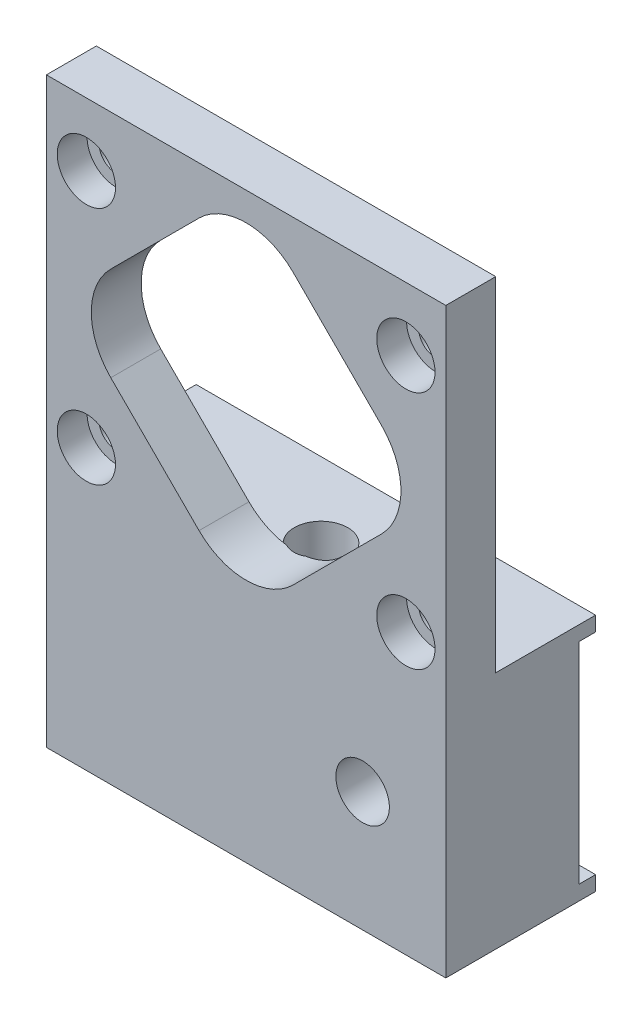
ISO-10303-21;
HEADER;
FILE_DESCRIPTION(('STEP AP214'),'2;1');
FILE_NAME('part.step','',(''),(''),'','','');
FILE_SCHEMA(('AUTOMOTIVE_DESIGN { 1 0 10303 214 1 1 1 1 }'));
ENDSEC;
DATA;
#1=APPLICATION_CONTEXT('core data for automotive mechanical design processes');
#2=APPLICATION_PROTOCOL_DEFINITION('international standard','automotive_design',2000,#1);
#3=PRODUCT_CONTEXT('',#1,'mechanical');
#4=PRODUCT('Part','Part','',(#3));
#5=PRODUCT_RELATED_PRODUCT_CATEGORY('part','',(#4));
#6=PRODUCT_DEFINITION_FORMATION('','',#4);
#7=PRODUCT_DEFINITION_CONTEXT('part definition',#1,'design');
#8=PRODUCT_DEFINITION('design','',#6,#7);
#9=PRODUCT_DEFINITION_SHAPE('','',#8);
#10=(LENGTH_UNIT() NAMED_UNIT(*) SI_UNIT(.MILLI.,.METRE.));
#11=(NAMED_UNIT(*) PLANE_ANGLE_UNIT() SI_UNIT($,.RADIAN.));
#12=(NAMED_UNIT(*) SI_UNIT($,.STERADIAN.) SOLID_ANGLE_UNIT());
#13=UNCERTAINTY_MEASURE_WITH_UNIT(LENGTH_MEASURE(1.E-05),#10,'distance_accuracy_value','');
#14=(GEOMETRIC_REPRESENTATION_CONTEXT(3) GLOBAL_UNCERTAINTY_ASSIGNED_CONTEXT((#13)) GLOBAL_UNIT_ASSIGNED_CONTEXT((#10,
#11,#12)) REPRESENTATION_CONTEXT('',''));
#15=CARTESIAN_POINT('',(0.,0.,0.));
#16=DIRECTION('',(0.,0.,1.));
#17=DIRECTION('',(1.,0.,0.));
#18=AXIS2_PLACEMENT_3D('',#15,#16,#17);
#19=CARTESIAN_POINT('',(19.05,-28.067,0.));
#20=DIRECTION('',(0.,0.,1.));
#21=DIRECTION('',(1.,0.,0.));
#22=AXIS2_PLACEMENT_3D('',#19,#20,#21);
#23=PLANE('',#22);
#24=DIRECTION('',(0.,1.,0.));
#25=VECTOR('',#24,1.);
#26=CARTESIAN_POINT('',(19.05,28.067,0.));
#27=LINE('',#26,#25);
#28=CARTESIAN_POINT('',(19.05,-6.62940000000001,0.));
#29=VERTEX_POINT('',#28);
#30=CARTESIAN_POINT('',(19.05,-5.23240000000001,0.));
#31=VERTEX_POINT('',#30);
#32=EDGE_CURVE('E309',#29,#31,#27,.T.);
#33=ORIENTED_EDGE('',*,*,#32,.F.);
#34=DIRECTION('',(1.,0.,0.));
#35=VECTOR('',#34,1.);
#36=CARTESIAN_POINT('',(19.05,-6.62940000000001,0.));
#37=LINE('',#36,#35);
#38=CARTESIAN_POINT('',(-19.05,-6.62940000000001,0.));
#39=VERTEX_POINT('',#38);
#40=EDGE_CURVE('E201',#39,#29,#37,.T.);
#41=ORIENTED_EDGE('',*,*,#40,.F.);
#42=DIRECTION('',(0.,-1.,0.));
#43=VECTOR('',#42,1.);
#44=CARTESIAN_POINT('',(-19.05,28.067,0.));
#45=LINE('',#44,#43);
#46=CARTESIAN_POINT('',(-19.05,-5.23240000000001,0.));
#47=VERTEX_POINT('',#46);
#48=EDGE_CURVE('E323',#47,#39,#45,.T.);
#49=ORIENTED_EDGE('',*,*,#48,.F.);
#50=DIRECTION('',(-1.,0.,0.));
#51=VECTOR('',#50,1.);
#52=CARTESIAN_POINT('',(-19.05,-5.23240000000001,0.));
#53=LINE('',#52,#51);
#54=EDGE_CURVE('E303',#31,#47,#53,.T.);
#55=ORIENTED_EDGE('',*,*,#54,.F.);
#56=EDGE_LOOP('',(#33,#41,#49,#55));
#57=FACE_BOUND('',#56,.T.);
#58=ADVANCED_FACE('F46',(#57),#23,.F.);
#59=CARTESIAN_POINT('',(11.1125,-16.6497,0.));
#60=DIRECTION('',(0.,0.,-1.));
#61=DIRECTION('',(-1.,0.,0.));
#62=AXIS2_PLACEMENT_3D('',#59,#60,#61);
#63=CYLINDRICAL_SURFACE('',#62,2.55269999999999);
#64=CARTESIAN_POINT('',(11.1125,-16.6497,14.2875));
#65=DIRECTION('',(0.,0.,-1.));
#66=DIRECTION('',(-1.,0.,0.));
#67=AXIS2_PLACEMENT_3D('',#64,#65,#66);
#68=CIRCLE('',#67,2.5527);
#69=CARTESIAN_POINT('',(8.55980000000002,-16.6497,14.2875));
#70=VERTEX_POINT('',#69);
#71=EDGE_CURVE('E214',#70,#70,#68,.T.);
#72=ORIENTED_EDGE('',*,*,#71,.F.);
#73=EDGE_LOOP('',(#72));
#74=FACE_BOUND('',#73,.T.);
#75=CARTESIAN_POINT('',(11.1125,-16.6497,1.5875));
#76=DIRECTION('',(0.,0.,-1.));
#77=DIRECTION('',(-1.,0.,0.));
#78=AXIS2_PLACEMENT_3D('',#75,#76,#77);
#79=CIRCLE('',#78,2.55269999999999);
#80=CARTESIAN_POINT('',(8.55980000000002,-16.6497,1.5875));
#81=VERTEX_POINT('',#80);
#82=EDGE_CURVE('E50',#81,#81,#79,.F.);
#83=ORIENTED_EDGE('',*,*,#82,.F.);
#84=EDGE_LOOP('',(#83));
#85=FACE_BOUND('',#84,.T.);
#86=ADVANCED_FACE('F389',(#74,#85),#63,.F.);
#87=CARTESIAN_POINT('',(19.05,28.067,14.2875));
#88=DIRECTION('',(-1.,0.,0.));
#89=DIRECTION('',(0.,-1.,0.));
#90=AXIS2_PLACEMENT_3D('',#87,#88,#89);
#91=PLANE('',#90);
#92=DIRECTION('',(0.,-1.,0.));
#93=VECTOR('',#92,1.);
#94=CARTESIAN_POINT('',(19.05,-6.62940000000001,1.5875));
#95=LINE('',#94,#93);
#96=CARTESIAN_POINT('',(19.05,-6.62940000000001,1.5875));
#97=VERTEX_POINT('',#96);
#98=CARTESIAN_POINT('',(19.05,-26.67,1.5875));
#99=VERTEX_POINT('',#98);
#100=EDGE_CURVE('E191',#97,#99,#95,.T.);
#101=ORIENTED_EDGE('',*,*,#100,.F.);
#102=DIRECTION('',(0.,0.,-1.));
#103=VECTOR('',#102,1.);
#104=CARTESIAN_POINT('',(19.05,-6.62940000000001,1.5875));
#105=LINE('',#104,#103);
#106=EDGE_CURVE('E443',#97,#29,#105,.T.);
#107=ORIENTED_EDGE('',*,*,#106,.T.);
#108=ORIENTED_EDGE('',*,*,#32,.T.);
#109=DIRECTION('',(0.,0.,-1.));
#110=VECTOR('',#109,1.);
#111=CARTESIAN_POINT('',(19.05,-5.23240000000001,0.));
#112=LINE('',#111,#110);
#113=CARTESIAN_POINT('',(19.05,-5.23240000000001,9.525));
#114=VERTEX_POINT('',#113);
#115=EDGE_CURVE('E300',#114,#31,#112,.T.);
#116=ORIENTED_EDGE('',*,*,#115,.F.);
#117=DIRECTION('',(0.,1.,0.));
#118=VECTOR('',#117,1.);
#119=CARTESIAN_POINT('',(19.05,-5.23240000000001,9.525));
#120=LINE('',#119,#118);
#121=CARTESIAN_POINT('',(19.05,27.4955,9.525));
#122=VERTEX_POINT('',#121);
#123=EDGE_CURVE('E306',#114,#122,#120,.T.);
#124=ORIENTED_EDGE('',*,*,#123,.T.);
#125=DIRECTION('',(0.,0.,-1.));
#126=VECTOR('',#125,1.);
#127=CARTESIAN_POINT('',(19.05,27.4955,9.525));
#128=LINE('',#127,#126);
#129=CARTESIAN_POINT('',(19.05,27.4955,14.2875));
#130=VERTEX_POINT('',#129);
#131=EDGE_CURVE('E71',#130,#122,#128,.T.);
#132=ORIENTED_EDGE('',*,*,#131,.F.);
#133=DIRECTION('',(0.,1.,0.));
#134=VECTOR('',#133,1.);
#135=CARTESIAN_POINT('',(19.05,28.067,14.2875));
#136=LINE('',#135,#134);
#137=CARTESIAN_POINT('',(19.05,-28.067,14.2875));
#138=VERTEX_POINT('',#137);
#139=EDGE_CURVE('E312',#138,#130,#136,.T.);
#140=ORIENTED_EDGE('',*,*,#139,.F.);
#141=DIRECTION('',(0.,0.,-1.));
#142=VECTOR('',#141,1.);
#143=CARTESIAN_POINT('',(19.05,-28.067,14.2875));
#144=LINE('',#143,#142);
#145=CARTESIAN_POINT('',(19.05,-28.067,0.));
#146=VERTEX_POINT('',#145);
#147=EDGE_CURVE('E320',#138,#146,#144,.T.);
#148=ORIENTED_EDGE('',*,*,#147,.T.);
#149=CARTESIAN_POINT('',(19.05,-26.67,0.));
#150=VERTEX_POINT('',#149);
#151=EDGE_CURVE('E207',#146,#150,#27,.T.);
#152=ORIENTED_EDGE('',*,*,#151,.T.);
#153=DIRECTION('',(0.,0.,-1.));
#154=VECTOR('',#153,1.);
#155=CARTESIAN_POINT('',(19.05,-26.67,1.5875));
#156=LINE('',#155,#154);
#157=EDGE_CURVE('E63',#99,#150,#156,.T.);
#158=ORIENTED_EDGE('',*,*,#157,.F.);
#159=EDGE_LOOP('',(#101,#107,#108,#116,#124,#132,#140,#148,#152,#158));
#160=FACE_BOUND('',#159,.T.);
#161=ADVANCED_FACE('F204',(#160),#91,.F.);
#162=CARTESIAN_POINT('',(-19.05,28.067,14.2875));
#163=DIRECTION('',(1.,0.,0.));
#164=DIRECTION('',(0.,1.,0.));
#165=AXIS2_PLACEMENT_3D('',#162,#163,#164);
#166=PLANE('',#165);
#167=ORIENTED_EDGE('',*,*,#48,.T.);
#168=DIRECTION('',(0.,0.,-1.));
#169=VECTOR('',#168,1.);
#170=CARTESIAN_POINT('',(-19.05,-6.62940000000001,1.5875));
#171=LINE('',#170,#169);
#172=CARTESIAN_POINT('',(-19.05,-6.62940000000001,1.5875));
#173=VERTEX_POINT('',#172);
#174=EDGE_CURVE('E209',#173,#39,#171,.T.);
#175=ORIENTED_EDGE('',*,*,#174,.F.);
#176=DIRECTION('',(0.,1.,0.));
#177=VECTOR('',#176,1.);
#178=CARTESIAN_POINT('',(-19.05,-6.62940000000001,1.5875));
#179=LINE('',#178,#177);
#180=CARTESIAN_POINT('',(-19.05,-26.67,1.5875));
#181=VERTEX_POINT('',#180);
#182=EDGE_CURVE('E190',#181,#173,#179,.T.);
#183=ORIENTED_EDGE('',*,*,#182,.F.);
#184=DIRECTION('',(0.,0.,-1.));
#185=VECTOR('',#184,1.);
#186=CARTESIAN_POINT('',(-19.05,-26.67,1.5875));
#187=LINE('',#186,#185);
#188=CARTESIAN_POINT('',(-19.05,-26.67,0.));
#189=VERTEX_POINT('',#188);
#190=EDGE_CURVE('E187',#181,#189,#187,.T.);
#191=ORIENTED_EDGE('',*,*,#190,.T.);
#192=CARTESIAN_POINT('',(-19.05,-28.067,0.));
#193=VERTEX_POINT('',#192);
#194=EDGE_CURVE('E322',#189,#193,#45,.T.);
#195=ORIENTED_EDGE('',*,*,#194,.T.);
#196=DIRECTION('',(0.,0.,-1.));
#197=VECTOR('',#196,1.);
#198=CARTESIAN_POINT('',(-19.05,-28.067,14.2875));
#199=LINE('',#198,#197);
#200=CARTESIAN_POINT('',(-19.05,-28.067,14.2875));
#201=VERTEX_POINT('',#200);
#202=EDGE_CURVE('E328',#201,#193,#199,.T.);
#203=ORIENTED_EDGE('',*,*,#202,.F.);
#204=DIRECTION('',(0.,-1.,0.));
#205=VECTOR('',#204,1.);
#206=CARTESIAN_POINT('',(-19.05,28.067,14.2875));
#207=LINE('',#206,#205);
#208=CARTESIAN_POINT('',(-19.05,27.4955,14.2875));
#209=VERTEX_POINT('',#208);
#210=EDGE_CURVE('E315',#209,#201,#207,.T.);
#211=ORIENTED_EDGE('',*,*,#210,.F.);
#212=DIRECTION('',(0.,0.,1.));
#213=VECTOR('',#212,1.);
#214=CARTESIAN_POINT('',(-19.05,27.4955,9.525));
#215=LINE('',#214,#213);
#216=CARTESIAN_POINT('',(-19.05,27.4955,9.525));
#217=VERTEX_POINT('',#216);
#218=EDGE_CURVE('E217',#217,#209,#215,.T.);
#219=ORIENTED_EDGE('',*,*,#218,.F.);
#220=DIRECTION('',(0.,1.,0.));
#221=VECTOR('',#220,1.);
#222=CARTESIAN_POINT('',(-19.05,-5.23240000000001,9.525));
#223=LINE('',#222,#221);
#224=CARTESIAN_POINT('',(-19.05,-5.23240000000001,9.525));
#225=VERTEX_POINT('',#224);
#226=EDGE_CURVE('E305',#225,#217,#223,.T.);
#227=ORIENTED_EDGE('',*,*,#226,.F.);
#228=DIRECTION('',(0.,0.,1.));
#229=VECTOR('',#228,1.);
#230=CARTESIAN_POINT('',(-19.05,-5.23240000000001,0.));
#231=LINE('',#230,#229);
#232=EDGE_CURVE('E294',#47,#225,#231,.T.);
#233=ORIENTED_EDGE('',*,*,#232,.F.);
#234=EDGE_LOOP('',(#167,#175,#183,#191,#195,#203,#211,#219,#227,#233));
#235=FACE_BOUND('',#234,.T.);
#236=ADVANCED_FACE('F417',(#235),#166,.F.);
#237=CARTESIAN_POINT('',(19.05,-28.067,14.2875));
#238=DIRECTION('',(0.,0.,1.));
#239=DIRECTION('',(1.,0.,0.));
#240=AXIS2_PLACEMENT_3D('',#237,#238,#239);
#241=PLANE('',#240);
#242=ORIENTED_EDGE('',*,*,#71,.T.);
#243=EDGE_LOOP('',(#242));
#244=FACE_BOUND('',#243,.T.);
#245=DIRECTION('',(0.707106781186548,0.707106781186548,0.));
#246=VECTOR('',#245,1.);
#247=CARTESIAN_POINT('',(0.,-7.36624623457149,14.2875));
#248=LINE('',#247,#246);
#249=CARTESIAN_POINT('',(4.49012806053458,-2.87611817403691,14.2875));
#250=VERTEX_POINT('',#249);
#251=CARTESIAN_POINT('',(12.9091181740369,5.54287193946543,14.2875));
#252=VERTEX_POINT('',#251);
#253=EDGE_CURVE('E275',#250,#252,#248,.T.);
#254=ORIENTED_EDGE('',*,*,#253,.F.);
#255=CARTESIAN_POINT('',(0.,1.61400988649767,14.2875));
#256=DIRECTION('',(0.,0.,1.));
#257=DIRECTION('',(1.,0.,0.));
#258=AXIS2_PLACEMENT_3D('',#255,#256,#257);
#259=CIRCLE('',#258,6.35);
#260=CARTESIAN_POINT('',(-4.49012806053458,-2.87611817403691,14.2875));
#261=VERTEX_POINT('',#260);
#262=EDGE_CURVE('E351',#250,#261,#259,.F.);
#263=ORIENTED_EDGE('',*,*,#262,.T.);
#264=DIRECTION('',(0.707106781186547,-0.707106781186548,0.));
#265=VECTOR('',#264,1.);
#266=CARTESIAN_POINT('',(0.,-7.36624623457149,14.2875));
#267=LINE('',#266,#265);
#268=CARTESIAN_POINT('',(-12.9091181740369,5.54287193946542,14.2875));
#269=VERTEX_POINT('',#268);
#270=EDGE_CURVE('E268',#269,#261,#267,.T.);
#271=ORIENTED_EDGE('',*,*,#270,.F.);
#272=CARTESIAN_POINT('',(-8.41899011350233,10.033,14.2875));
#273=DIRECTION('',(0.,0.,1.));
#274=DIRECTION('',(1.,0.,0.));
#275=AXIS2_PLACEMENT_3D('',#272,#273,#274);
#276=CIRCLE('',#275,6.35);
#277=CARTESIAN_POINT('',(-12.9091181740369,14.5231280605346,14.2875));
#278=VERTEX_POINT('',#277);
#279=EDGE_CURVE('E466',#269,#278,#276,.F.);
#280=ORIENTED_EDGE('',*,*,#279,.T.);
#281=DIRECTION('',(-0.707106781186547,-0.707106781186548,0.));
#282=VECTOR('',#281,1.);
#283=CARTESIAN_POINT('',(-17.3992462345715,10.033,14.2875));
#284=LINE('',#283,#282);
#285=CARTESIAN_POINT('',(-4.49012806053458,22.9421181740369,14.2875));
#286=VERTEX_POINT('',#285);
#287=EDGE_CURVE('E281',#286,#278,#284,.T.);
#288=ORIENTED_EDGE('',*,*,#287,.F.);
#289=CARTESIAN_POINT('',(0.,18.4519901135023,14.2875));
#290=DIRECTION('',(0.,0.,1.));
#291=DIRECTION('',(1.,0.,0.));
#292=AXIS2_PLACEMENT_3D('',#289,#290,#291);
#293=CIRCLE('',#292,6.35);
#294=CARTESIAN_POINT('',(4.49012806053457,22.9421181740369,14.2875));
#295=VERTEX_POINT('',#294);
#296=EDGE_CURVE('E460',#286,#295,#293,.F.);
#297=ORIENTED_EDGE('',*,*,#296,.T.);
#298=DIRECTION('',(-0.707106781186548,0.707106781186548,0.));
#299=VECTOR('',#298,1.);
#300=CARTESIAN_POINT('',(17.3992462345715,10.033,14.2875));
#301=LINE('',#300,#299);
#302=CARTESIAN_POINT('',(12.9091181740369,14.5231280605346,14.2875));
#303=VERTEX_POINT('',#302);
#304=EDGE_CURVE('E278',#303,#295,#301,.T.);
#305=ORIENTED_EDGE('',*,*,#304,.F.);
#306=CARTESIAN_POINT('',(8.41899011350233,10.033,14.2875));
#307=DIRECTION('',(0.,0.,1.));
#308=DIRECTION('',(1.,0.,0.));
#309=AXIS2_PLACEMENT_3D('',#306,#307,#308);
#310=CIRCLE('',#309,6.35);
#311=EDGE_CURVE('E455',#303,#252,#310,.F.);
#312=ORIENTED_EDGE('',*,*,#311,.T.);
#313=EDGE_LOOP('',(#254,#263,#271,#280,#288,#297,#305,#312));
#314=FACE_BOUND('',#313,.T.);
#315=CARTESIAN_POINT('',(-15.24,-1.397,14.2875));
#316=DIRECTION('',(0.,0.,1.));
#317=DIRECTION('',(1.,0.,0.));
#318=AXIS2_PLACEMENT_3D('',#315,#316,#317);
#319=CIRCLE('',#318,2.77875999999999);
#320=CARTESIAN_POINT('',(-12.46124,-1.397,14.2875));
#321=VERTEX_POINT('',#320);
#322=EDGE_CURVE('E254',#321,#321,#319,.T.);
#323=ORIENTED_EDGE('',*,*,#322,.F.);
#324=EDGE_LOOP('',(#323));
#325=FACE_BOUND('',#324,.T.);
#326=CARTESIAN_POINT('',(15.24,-1.397,14.2875));
#327=DIRECTION('',(0.,0.,1.));
#328=DIRECTION('',(1.,0.,0.));
#329=AXIS2_PLACEMENT_3D('',#326,#327,#328);
#330=CIRCLE('',#329,2.77875999999999);
#331=CARTESIAN_POINT('',(18.01876,-1.397,14.2875));
#332=VERTEX_POINT('',#331);
#333=EDGE_CURVE('E244',#332,#332,#330,.T.);
#334=ORIENTED_EDGE('',*,*,#333,.F.);
#335=EDGE_LOOP('',(#334));
#336=FACE_BOUND('',#335,.T.);
#337=CARTESIAN_POINT('',(15.24,21.463,14.2875));
#338=DIRECTION('',(0.,0.,1.));
#339=DIRECTION('',(1.,0.,0.));
#340=AXIS2_PLACEMENT_3D('',#337,#338,#339);
#341=CIRCLE('',#340,2.77876);
#342=CARTESIAN_POINT('',(18.01876,21.463,14.2875));
#343=VERTEX_POINT('',#342);
#344=EDGE_CURVE('E234',#343,#343,#341,.T.);
#345=ORIENTED_EDGE('',*,*,#344,.F.);
#346=EDGE_LOOP('',(#345));
#347=FACE_BOUND('',#346,.T.);
#348=CARTESIAN_POINT('',(-15.24,21.463,14.2875));
#349=DIRECTION('',(0.,0.,1.));
#350=DIRECTION('',(1.,0.,0.));
#351=AXIS2_PLACEMENT_3D('',#348,#349,#350);
#352=CIRCLE('',#351,2.77875999999999);
#353=CARTESIAN_POINT('',(-12.46124,21.463,14.2875));
#354=VERTEX_POINT('',#353);
#355=EDGE_CURVE('E224',#354,#354,#352,.T.);
#356=ORIENTED_EDGE('',*,*,#355,.F.);
#357=EDGE_LOOP('',(#356));
#358=FACE_BOUND('',#357,.T.);
#359=ORIENTED_EDGE('',*,*,#139,.T.);
#360=DIRECTION('',(1.,0.,0.));
#361=VECTOR('',#360,1.);
#362=CARTESIAN_POINT('',(-19.05,27.4955,14.2875));
#363=LINE('',#362,#361);
#364=EDGE_CURVE('E219',#209,#130,#363,.T.);
#365=ORIENTED_EDGE('',*,*,#364,.F.);
#366=ORIENTED_EDGE('',*,*,#210,.T.);
#367=DIRECTION('',(1.,0.,0.));
#368=VECTOR('',#367,1.);
#369=CARTESIAN_POINT('',(-19.05,-28.067,14.2875));
#370=LINE('',#369,#368);
#371=EDGE_CURVE('E318',#201,#138,#370,.T.);
#372=ORIENTED_EDGE('',*,*,#371,.T.);
#373=EDGE_LOOP('',(#359,#365,#366,#372));
#374=FACE_BOUND('',#373,.T.);
#375=ADVANCED_FACE('F424',(#244,#314,#325,#336,#347,#358,#374),#241,.T.);
#376=CARTESIAN_POINT('',(-19.05,-5.23240000000001,9.525));
#377=DIRECTION('',(0.,0.,1.));
#378=DIRECTION('',(1.,0.,0.));
#379=AXIS2_PLACEMENT_3D('',#376,#377,#378);
#380=PLANE('',#379);
#381=CARTESIAN_POINT('',(-15.24,-1.397,9.525));
#382=DIRECTION('',(0.,0.,1.));
#383=DIRECTION('',(1.,0.,0.));
#384=AXIS2_PLACEMENT_3D('',#381,#382,#383);
#385=CIRCLE('',#384,1.63195);
#386=CARTESIAN_POINT('',(-13.60805,-1.397,9.525));
#387=VERTEX_POINT('',#386);
#388=EDGE_CURVE('E263',#387,#387,#385,.T.);
#389=ORIENTED_EDGE('',*,*,#388,.T.);
#390=EDGE_LOOP('',(#389));
#391=FACE_BOUND('',#390,.T.);
#392=CARTESIAN_POINT('',(15.24,-1.397,9.525));
#393=DIRECTION('',(0.,0.,1.));
#394=DIRECTION('',(1.,0.,0.));
#395=AXIS2_PLACEMENT_3D('',#392,#393,#394);
#396=CIRCLE('',#395,1.63195000000001);
#397=CARTESIAN_POINT('',(16.87195,-1.397,9.525));
#398=VERTEX_POINT('',#397);
#399=EDGE_CURVE('E253',#398,#398,#396,.T.);
#400=ORIENTED_EDGE('',*,*,#399,.T.);
#401=EDGE_LOOP('',(#400));
#402=FACE_BOUND('',#401,.T.);
#403=CARTESIAN_POINT('',(15.24,21.463,9.525));
#404=DIRECTION('',(0.,0.,1.));
#405=DIRECTION('',(1.,0.,0.));
#406=AXIS2_PLACEMENT_3D('',#403,#404,#405);
#407=CIRCLE('',#406,1.63195000000001);
#408=CARTESIAN_POINT('',(16.87195,21.463,9.525));
#409=VERTEX_POINT('',#408);
#410=EDGE_CURVE('E243',#409,#409,#407,.T.);
#411=ORIENTED_EDGE('',*,*,#410,.T.);
#412=EDGE_LOOP('',(#411));
#413=FACE_BOUND('',#412,.T.);
#414=CARTESIAN_POINT('',(-15.24,21.463,9.525));
#415=DIRECTION('',(0.,0.,1.));
#416=DIRECTION('',(1.,0.,0.));
#417=AXIS2_PLACEMENT_3D('',#414,#415,#416);
#418=CIRCLE('',#417,1.63195);
#419=CARTESIAN_POINT('',(-13.60805,21.463,9.525));
#420=VERTEX_POINT('',#419);
#421=EDGE_CURVE('E233',#420,#420,#418,.T.);
#422=ORIENTED_EDGE('',*,*,#421,.T.);
#423=EDGE_LOOP('',(#422));
#424=FACE_BOUND('',#423,.T.);
#425=DIRECTION('',(-1.,0.,0.));
#426=VECTOR('',#425,1.);
#427=CARTESIAN_POINT('',(-19.05,27.4955,9.525));
#428=LINE('',#427,#426);
#429=EDGE_CURVE('E222',#122,#217,#428,.T.);
#430=ORIENTED_EDGE('',*,*,#429,.F.);
#431=ORIENTED_EDGE('',*,*,#123,.F.);
#432=DIRECTION('',(1.,0.,0.));
#433=VECTOR('',#432,1.);
#434=CARTESIAN_POINT('',(-19.05,-5.23240000000001,9.525));
#435=LINE('',#434,#433);
#436=CARTESIAN_POINT('',(0.919742207088466,-5.23240000000001,9.525));
#437=VERTEX_POINT('',#436);
#438=EDGE_CURVE('E297',#437,#114,#435,.T.);
#439=ORIENTED_EDGE('',*,*,#438,.F.);
#440=DIRECTION('',(0.,-1.,0.));
#441=VECTOR('',#440,1.);
#442=CARTESIAN_POINT('',(0.919742207088469,-5.23240000000001,9.525));
#443=LINE('',#442,#441);
#444=CARTESIAN_POINT('',(0.919742207088471,-4.66902873128115,9.525));
#445=VERTEX_POINT('',#444);
#446=EDGE_CURVE('E13',#437,#445,#443,.F.);
#447=ORIENTED_EDGE('',*,*,#446,.T.);
#448=CARTESIAN_POINT('',(0.,1.61400988649767,9.525));
#449=DIRECTION('',(0.,0.,1.));
#450=DIRECTION('',(1.,0.,0.));
#451=AXIS2_PLACEMENT_3D('',#448,#449,#450);
#452=CIRCLE('',#451,6.35);
#453=CARTESIAN_POINT('',(4.49012806053458,-2.87611817403691,9.525));
#454=VERTEX_POINT('',#453);
#455=EDGE_CURVE('E362',#445,#454,#452,.T.);
#456=ORIENTED_EDGE('',*,*,#455,.T.);
#457=DIRECTION('',(-0.707106781186548,-0.707106781186548,0.));
#458=VECTOR('',#457,1.);
#459=CARTESIAN_POINT('',(0.,-7.36624623457149,9.525));
#460=LINE('',#459,#458);
#461=CARTESIAN_POINT('',(12.9091181740369,5.54287193946543,9.525));
#462=VERTEX_POINT('',#461);
#463=EDGE_CURVE('E271',#462,#454,#460,.T.);
#464=ORIENTED_EDGE('',*,*,#463,.F.);
#465=CARTESIAN_POINT('',(8.41899011350233,10.033,9.525));
#466=DIRECTION('',(0.,0.,1.));
#467=DIRECTION('',(1.,0.,0.));
#468=AXIS2_PLACEMENT_3D('',#465,#466,#467);
#469=CIRCLE('',#468,6.35);
#470=CARTESIAN_POINT('',(12.9091181740369,14.5231280605346,9.525));
#471=VERTEX_POINT('',#470);
#472=EDGE_CURVE('E456',#462,#471,#469,.T.);
#473=ORIENTED_EDGE('',*,*,#472,.T.);
#474=DIRECTION('',(0.707106781186548,-0.707106781186548,0.));
#475=VECTOR('',#474,1.);
#476=CARTESIAN_POINT('',(17.3992462345715,10.033,9.525));
#477=LINE('',#476,#475);
#478=CARTESIAN_POINT('',(4.49012806053457,22.9421181740369,9.525));
#479=VERTEX_POINT('',#478);
#480=EDGE_CURVE('E274',#479,#471,#477,.T.);
#481=ORIENTED_EDGE('',*,*,#480,.F.);
#482=CARTESIAN_POINT('',(0.,18.4519901135023,9.525));
#483=DIRECTION('',(0.,0.,1.));
#484=DIRECTION('',(1.,0.,0.));
#485=AXIS2_PLACEMENT_3D('',#482,#483,#484);
#486=CIRCLE('',#485,6.35);
#487=CARTESIAN_POINT('',(-4.49012806053458,22.9421181740369,9.525));
#488=VERTEX_POINT('',#487);
#489=EDGE_CURVE('E464',#479,#488,#486,.T.);
#490=ORIENTED_EDGE('',*,*,#489,.T.);
#491=DIRECTION('',(0.707106781186547,0.707106781186548,0.));
#492=VECTOR('',#491,1.);
#493=CARTESIAN_POINT('',(-17.3992462345715,10.033,9.525));
#494=LINE('',#493,#492);
#495=CARTESIAN_POINT('',(-12.9091181740369,14.5231280605346,9.525));
#496=VERTEX_POINT('',#495);
#497=EDGE_CURVE('E264',#496,#488,#494,.T.);
#498=ORIENTED_EDGE('',*,*,#497,.F.);
#499=CARTESIAN_POINT('',(-8.41899011350233,10.033,9.525));
#500=DIRECTION('',(0.,0.,1.));
#501=DIRECTION('',(1.,0.,0.));
#502=AXIS2_PLACEMENT_3D('',#499,#500,#501);
#503=CIRCLE('',#502,6.35);
#504=CARTESIAN_POINT('',(-12.9091181740369,5.54287193946543,9.525));
#505=VERTEX_POINT('',#504);
#506=EDGE_CURVE('E468',#496,#505,#503,.T.);
#507=ORIENTED_EDGE('',*,*,#506,.T.);
#508=DIRECTION('',(-0.707106781186547,0.707106781186548,0.));
#509=VECTOR('',#508,1.);
#510=CARTESIAN_POINT('',(0.,-7.36624623457149,9.525));
#511=LINE('',#510,#509);
#512=CARTESIAN_POINT('',(-4.49012806053458,-2.87611817403691,9.525));
#513=VERTEX_POINT('',#512);
#514=EDGE_CURVE('E267',#513,#505,#511,.T.);
#515=ORIENTED_EDGE('',*,*,#514,.F.);
#516=CARTESIAN_POINT('',(0.,1.61400988649767,9.525));
#517=DIRECTION('',(0.,0.,1.));
#518=DIRECTION('',(1.,0.,0.));
#519=AXIS2_PLACEMENT_3D('',#516,#517,#518);
#520=CIRCLE('',#519,6.35);
#521=CARTESIAN_POINT('',(-0.919742207088471,-4.66902873128115,9.525));
#522=VERTEX_POINT('',#521);
#523=EDGE_CURVE('E353',#513,#522,#520,.T.);
#524=ORIENTED_EDGE('',*,*,#523,.T.);
#525=DIRECTION('',(0.,-1.,0.));
#526=VECTOR('',#525,1.);
#527=CARTESIAN_POINT('',(-0.919742207088475,-5.23240000000001,9.525));
#528=LINE('',#527,#526);
#529=CARTESIAN_POINT('',(-0.919742207088471,-5.23240000000001,9.525));
#530=VERTEX_POINT('',#529);
#531=EDGE_CURVE('E55',#530,#522,#528,.F.);
#532=ORIENTED_EDGE('',*,*,#531,.F.);
#533=EDGE_CURVE('E298',#225,#530,#435,.T.);
#534=ORIENTED_EDGE('',*,*,#533,.F.);
#535=ORIENTED_EDGE('',*,*,#226,.T.);
#536=EDGE_LOOP('',(#430,#431,#439,#447,#456,#464,#473,#481,#490,#498,#507,#515,#524,#532,#534,#535));
#537=FACE_BOUND('',#536,.T.);
#538=ADVANCED_FACE('F430',(#391,#402,#413,#424,#537),#380,.F.);
#539=CARTESIAN_POINT('',(0.,-28.067,7.14375));
#540=DIRECTION('',(0.,-1.,0.));
#541=DIRECTION('',(0.,0.,-1.));
#542=AXIS2_PLACEMENT_3D('',#539,#540,#541);
#543=CYLINDRICAL_SURFACE('',#542,2.55269999999999);
#544=CARTESIAN_POINT('',(0.,-28.067,7.14375));
#545=DIRECTION('',(0.,-1.,0.));
#546=DIRECTION('',(0.,0.,-1.));
#547=AXIS2_PLACEMENT_3D('',#544,#545,#546);
#548=CIRCLE('',#547,2.55269999999999);
#549=CARTESIAN_POINT('',(0.,-28.067,4.59105000000001));
#550=VERTEX_POINT('',#549);
#551=EDGE_CURVE('E288',#550,#550,#548,.T.);
#552=ORIENTED_EDGE('',*,*,#551,.T.);
#553=EDGE_LOOP('',(#552));
#554=FACE_BOUND('',#553,.T.);
#555=CARTESIAN_POINT('',(0.,-5.23240000000001,7.14375));
#556=DIRECTION('',(0.,1.,0.));
#557=DIRECTION('',(0.,0.,1.));
#558=AXIS2_PLACEMENT_3D('',#555,#556,#557);
#559=CIRCLE('',#558,2.55269999999999);
#560=EDGE_CURVE('E291',#530,#437,#559,.F.);
#561=ORIENTED_EDGE('',*,*,#560,.F.);
#562=ORIENTED_EDGE('',*,*,#531,.T.);
#563=CARTESIAN_POINT('',(-0.919742207088471,-4.66902873128115,9.525));
#564=CARTESIAN_POINT('',(-0.857399423755111,-4.67816247426388,9.54908703480637));
#565=CARTESIAN_POINT('',(-0.793998269154302,-4.68648811426272,9.57075398065403));
#566=CARTESIAN_POINT('',(-0.665484745421053,-4.70135154923995,9.60908886168109));
#567=CARTESIAN_POINT('',(-0.600372032795788,-4.70788898229344,9.62575578494476));
#568=CARTESIAN_POINT('',(-0.46885950999686,-4.71900111829218,9.6539234053384));
#569=CARTESIAN_POINT('',(-0.402459564181881,-4.72357561320624,9.66542355490238));
#570=CARTESIAN_POINT('',(-0.268873785112468,-4.73064856081441,9.68314557055177));
#571=CARTESIAN_POINT('',(-0.201688049021464,-4.73314726748552,9.68936808236906));
#572=CARTESIAN_POINT('',(0.000573568166113518,-4.73741679743966,9.70001314194897));
#573=CARTESIAN_POINT('',(0.136239296887992,-4.73595117450228,9.69638869092049));
#574=CARTESIAN_POINT('',(0.404677168799698,-4.72450450876338,9.6677754287183));
#575=CARTESIAN_POINT('',(0.537454150236739,-4.71453904455055,9.64282570253214));
#576=CARTESIAN_POINT('',(0.709874030071987,-4.69633592605444,9.59616640312714));
#577=CARTESIAN_POINT('',(0.752456107157045,-4.69139451405042,9.58343489865753));
#578=CARTESIAN_POINT('',(0.836752810798615,-4.68076091202033,9.55581985558998));
#579=CARTESIAN_POINT('',(0.8784685959017,-4.67506981101566,9.54093943561083));
#580=CARTESIAN_POINT('',(0.919742207088471,-4.66902873128115,9.525));
#581=B_SPLINE_CURVE_WITH_KNOTS('',3,(#563,#564,#565,#566,#567,#568,#569,#570,#571,#572,#573,
#574,#575,#576,#577,#578,#579,#580),.UNSPECIFIED.,.F.,.F.,(4,2,2,2,2,2,2,2,4),(0.,
0.202316251919804,0.404673421475004,0.607052031447233,0.809405876328186,1.21446165912252,
1.61877664324102,1.75288397184221,1.88679859706198),.UNSPECIFIED.);
#582=EDGE_CURVE('E355',#522,#445,#581,.T.);
#583=ORIENTED_EDGE('',*,*,#582,.T.);
#584=ORIENTED_EDGE('',*,*,#446,.F.);
#585=EDGE_LOOP('',(#561,#562,#583,#584));
#586=FACE_BOUND('',#585,.T.);
#587=ADVANCED_FACE('F364',(#554,#586),#543,.F.);
#588=CARTESIAN_POINT('',(-19.05,-5.23240000000001,9.525));
#589=DIRECTION('',(0.,1.,0.));
#590=DIRECTION('',(0.,0.,1.));
#591=AXIS2_PLACEMENT_3D('',#588,#589,#590);
#592=PLANE('',#591);
#593=ORIENTED_EDGE('',*,*,#533,.T.);
#594=ORIENTED_EDGE('',*,*,#560,.T.);
#595=ORIENTED_EDGE('',*,*,#438,.T.);
#596=ORIENTED_EDGE('',*,*,#115,.T.);
#597=ORIENTED_EDGE('',*,*,#54,.T.);
#598=ORIENTED_EDGE('',*,*,#232,.T.);
#599=EDGE_LOOP('',(#593,#594,#595,#596,#597,#598));
#600=FACE_BOUND('',#599,.T.);
#601=ADVANCED_FACE('F403',(#600),#592,.T.);
#602=ORIENTED_EDGE('',*,*,#194,.F.);
#603=DIRECTION('',(-1.,0.,0.));
#604=VECTOR('',#603,1.);
#605=CARTESIAN_POINT('',(19.05,-26.67,0.));
#606=LINE('',#605,#604);
#607=EDGE_CURVE('E414',#150,#189,#606,.T.);
#608=ORIENTED_EDGE('',*,*,#607,.F.);
#609=ORIENTED_EDGE('',*,*,#151,.F.);
#610=DIRECTION('',(1.,0.,0.));
#611=VECTOR('',#610,1.);
#612=CARTESIAN_POINT('',(-19.05,-28.067,0.));
#613=LINE('',#612,#611);
#614=EDGE_CURVE('E316',#193,#146,#613,.T.);
#615=ORIENTED_EDGE('',*,*,#614,.F.);
#616=EDGE_LOOP('',(#602,#608,#609,#615));
#617=FACE_BOUND('',#616,.T.);
#618=ADVANCED_FACE('F392',(#617),#23,.F.);
#619=CARTESIAN_POINT('',(-19.05,-28.067,14.2875));
#620=DIRECTION('',(0.,1.,0.));
#621=DIRECTION('',(0.,0.,1.));
#622=AXIS2_PLACEMENT_3D('',#619,#620,#621);
#623=PLANE('',#622);
#624=ORIENTED_EDGE('',*,*,#551,.F.);
#625=EDGE_LOOP('',(#624));
#626=FACE_BOUND('',#625,.T.);
#627=ORIENTED_EDGE('',*,*,#614,.T.);
#628=ORIENTED_EDGE('',*,*,#147,.F.);
#629=ORIENTED_EDGE('',*,*,#371,.F.);
#630=ORIENTED_EDGE('',*,*,#202,.T.);
#631=EDGE_LOOP('',(#627,#628,#629,#630));
#632=FACE_BOUND('',#631,.T.);
#633=ADVANCED_FACE('F402',(#626,#632),#623,.F.);
#634=CARTESIAN_POINT('',(0.,-7.36624623457149,-39.6875));
#635=DIRECTION('',(0.707106781186547,-0.707106781186547,0.));
#636=DIRECTION('',(0.707106781186548,0.707106781186548,0.));
#637=AXIS2_PLACEMENT_3D('',#634,#635,#636);
#638=PLANE('',#637);
#639=ORIENTED_EDGE('',*,*,#463,.T.);
#640=DIRECTION('',(0.,0.,1.));
#641=VECTOR('',#640,1.);
#642=CARTESIAN_POINT('',(4.49012806053458,-2.87611817403691,14.2875));
#643=LINE('',#642,#641);
#644=EDGE_CURVE('E333',#454,#250,#643,.T.);
#645=ORIENTED_EDGE('',*,*,#644,.T.);
#646=ORIENTED_EDGE('',*,*,#253,.T.);
#647=DIRECTION('',(0.,0.,1.));
#648=VECTOR('',#647,1.);
#649=CARTESIAN_POINT('',(12.9091181740369,5.54287193946542,9.525));
#650=LINE('',#649,#648);
#651=EDGE_CURVE('E331',#252,#462,#650,.F.);
#652=ORIENTED_EDGE('',*,*,#651,.T.);
#653=EDGE_LOOP('',(#639,#645,#646,#652));
#654=FACE_BOUND('',#653,.T.);
#655=ADVANCED_FACE('F409',(#654),#638,.F.);
#656=CARTESIAN_POINT('',(0.,-7.36624623457149,-39.6875));
#657=DIRECTION('',(-0.707106781186548,-0.707106781186547,0.));
#658=DIRECTION('',(0.707106781186547,-0.707106781186548,0.));
#659=AXIS2_PLACEMENT_3D('',#656,#657,#658);
#660=PLANE('',#659);
#661=ORIENTED_EDGE('',*,*,#270,.T.);
#662=DIRECTION('',(0.,0.,1.));
#663=VECTOR('',#662,1.);
#664=CARTESIAN_POINT('',(-4.49012806053458,-2.87611817403691,9.69644999999998));
#665=LINE('',#664,#663);
#666=EDGE_CURVE('E339',#261,#513,#665,.F.);
#667=ORIENTED_EDGE('',*,*,#666,.T.);
#668=ORIENTED_EDGE('',*,*,#514,.T.);
#669=DIRECTION('',(0.,0.,1.));
#670=VECTOR('',#669,1.);
#671=CARTESIAN_POINT('',(-12.9091181740369,5.54287193946542,14.2875));
#672=LINE('',#671,#670);
#673=EDGE_CURVE('E336',#505,#269,#672,.T.);
#674=ORIENTED_EDGE('',*,*,#673,.T.);
#675=EDGE_LOOP('',(#661,#667,#668,#674));
#676=FACE_BOUND('',#675,.T.);
#677=ADVANCED_FACE('F528',(#676),#660,.F.);
#678=CARTESIAN_POINT('',(-17.3992462345715,10.033,-39.6875));
#679=DIRECTION('',(-0.707106781186548,0.707106781186547,0.));
#680=DIRECTION('',(-0.707106781186547,-0.707106781186548,0.));
#681=AXIS2_PLACEMENT_3D('',#678,#679,#680);
#682=PLANE('',#681);
#683=ORIENTED_EDGE('',*,*,#497,.T.);
#684=DIRECTION('',(0.,0.,1.));
#685=VECTOR('',#684,1.);
#686=CARTESIAN_POINT('',(-4.49012806053458,22.9421181740369,14.2875));
#687=LINE('',#686,#685);
#688=EDGE_CURVE('E348',#488,#286,#687,.T.);
#689=ORIENTED_EDGE('',*,*,#688,.T.);
#690=ORIENTED_EDGE('',*,*,#287,.T.);
#691=DIRECTION('',(0.,0.,1.));
#692=VECTOR('',#691,1.);
#693=CARTESIAN_POINT('',(-12.9091181740369,14.5231280605346,9.525));
#694=LINE('',#693,#692);
#695=EDGE_CURVE('E346',#278,#496,#694,.F.);
#696=ORIENTED_EDGE('',*,*,#695,.T.);
#697=EDGE_LOOP('',(#683,#689,#690,#696));
#698=FACE_BOUND('',#697,.T.);
#699=ADVANCED_FACE('F531',(#698),#682,.F.);
#700=CARTESIAN_POINT('',(17.3992462345715,10.033,-39.6875));
#701=DIRECTION('',(0.707106781186547,0.707106781186547,0.));
#702=DIRECTION('',(-0.707106781186548,0.707106781186548,0.));
#703=AXIS2_PLACEMENT_3D('',#700,#701,#702);
#704=PLANE('',#703);
#705=ORIENTED_EDGE('',*,*,#480,.T.);
#706=DIRECTION('',(0.,0.,1.));
#707=VECTOR('',#706,1.);
#708=CARTESIAN_POINT('',(12.9091181740369,14.5231280605346,14.2875));
#709=LINE('',#708,#707);
#710=EDGE_CURVE('E343',#471,#303,#709,.T.);
#711=ORIENTED_EDGE('',*,*,#710,.T.);
#712=ORIENTED_EDGE('',*,*,#304,.T.);
#713=DIRECTION('',(0.,0.,1.));
#714=VECTOR('',#713,1.);
#715=CARTESIAN_POINT('',(4.49012806053458,22.9421181740369,9.52499999999998));
#716=LINE('',#715,#714);
#717=EDGE_CURVE('E341',#295,#479,#716,.F.);
#718=ORIENTED_EDGE('',*,*,#717,.T.);
#719=EDGE_LOOP('',(#705,#711,#712,#718));
#720=FACE_BOUND('',#719,.T.);
#721=ADVANCED_FACE('F374',(#720),#704,.F.);
#722=CARTESIAN_POINT('',(0.,1.61400988649767,-39.6875));
#723=DIRECTION('',(0.,0.,-1.));
#724=DIRECTION('',(-1.,0.,0.));
#725=AXIS2_PLACEMENT_3D('',#722,#723,#724);
#726=CYLINDRICAL_SURFACE('',#725,6.35);
#727=ORIENTED_EDGE('',*,*,#523,.F.);
#728=ORIENTED_EDGE('',*,*,#666,.F.);
#729=ORIENTED_EDGE('',*,*,#262,.F.);
#730=ORIENTED_EDGE('',*,*,#644,.F.);
#731=ORIENTED_EDGE('',*,*,#455,.F.);
#732=ORIENTED_EDGE('',*,*,#582,.F.);
#733=EDGE_LOOP('',(#727,#728,#729,#730,#731,#732));
#734=FACE_BOUND('',#733,.T.);
#735=ADVANCED_FACE('F368',(#734),#726,.F.);
#736=CARTESIAN_POINT('',(8.41899011350233,10.033,-39.6875));
#737=DIRECTION('',(0.,0.,-1.));
#738=DIRECTION('',(-1.,0.,0.));
#739=AXIS2_PLACEMENT_3D('',#736,#737,#738);
#740=CYLINDRICAL_SURFACE('',#739,6.35);
#741=ORIENTED_EDGE('',*,*,#472,.F.);
#742=ORIENTED_EDGE('',*,*,#651,.F.);
#743=ORIENTED_EDGE('',*,*,#311,.F.);
#744=ORIENTED_EDGE('',*,*,#710,.F.);
#745=EDGE_LOOP('',(#741,#742,#743,#744));
#746=FACE_BOUND('',#745,.T.);
#747=ADVANCED_FACE('F373',(#746),#740,.F.);
#748=CARTESIAN_POINT('',(0.,18.4519901135023,-39.6875));
#749=DIRECTION('',(0.,0.,-1.));
#750=DIRECTION('',(-1.,0.,0.));
#751=AXIS2_PLACEMENT_3D('',#748,#749,#750);
#752=CYLINDRICAL_SURFACE('',#751,6.35);
#753=ORIENTED_EDGE('',*,*,#489,.F.);
#754=ORIENTED_EDGE('',*,*,#717,.F.);
#755=ORIENTED_EDGE('',*,*,#296,.F.);
#756=ORIENTED_EDGE('',*,*,#688,.F.);
#757=EDGE_LOOP('',(#753,#754,#755,#756));
#758=FACE_BOUND('',#757,.T.);
#759=ADVANCED_FACE('F378',(#758),#752,.F.);
#760=CARTESIAN_POINT('',(-8.41899011350233,10.033,-39.6875));
#761=DIRECTION('',(0.,0.,-1.));
#762=DIRECTION('',(-1.,0.,0.));
#763=AXIS2_PLACEMENT_3D('',#760,#761,#762);
#764=CYLINDRICAL_SURFACE('',#763,6.35);
#765=ORIENTED_EDGE('',*,*,#506,.F.);
#766=ORIENTED_EDGE('',*,*,#695,.F.);
#767=ORIENTED_EDGE('',*,*,#279,.F.);
#768=ORIENTED_EDGE('',*,*,#673,.F.);
#769=EDGE_LOOP('',(#765,#766,#767,#768));
#770=FACE_BOUND('',#769,.T.);
#771=ADVANCED_FACE('F48',(#770),#764,.F.);
#772=CARTESIAN_POINT('',(-15.24,-1.397,14.2875));
#773=DIRECTION('',(0.,0.,1.));
#774=DIRECTION('',(1.,0.,0.));
#775=AXIS2_PLACEMENT_3D('',#772,#773,#774);
#776=CYLINDRICAL_SURFACE('',#775,1.63195);
#777=CARTESIAN_POINT('',(-15.24,-1.397,11.4427));
#778=DIRECTION('',(0.,0.,1.));
#779=DIRECTION('',(1.,0.,0.));
#780=AXIS2_PLACEMENT_3D('',#777,#778,#779);
#781=CIRCLE('',#780,1.63195000000001);
#782=CARTESIAN_POINT('',(-13.60805,-1.397,11.4427));
#783=VERTEX_POINT('',#782);
#784=EDGE_CURVE('E260',#783,#783,#781,.T.);
#785=ORIENTED_EDGE('',*,*,#784,.T.);
#786=EDGE_LOOP('',(#785));
#787=FACE_BOUND('',#786,.T.);
#788=ORIENTED_EDGE('',*,*,#388,.F.);
#789=EDGE_LOOP('',(#788));
#790=FACE_BOUND('',#789,.T.);
#791=ADVANCED_FACE('F385',(#787,#790),#776,.F.);
#792=CARTESIAN_POINT('',(-13.60805,-1.397,11.4427));
#793=DIRECTION('',(0.,0.,-1.));
#794=DIRECTION('',(-1.,0.,0.));
#795=AXIS2_PLACEMENT_3D('',#792,#793,#794);
#796=PLANE('',#795);
#797=ORIENTED_EDGE('',*,*,#784,.F.);
#798=EDGE_LOOP('',(#797));
#799=FACE_BOUND('',#798,.T.);
#800=CARTESIAN_POINT('',(-15.24,-1.397,11.4427));
#801=DIRECTION('',(0.,0.,1.));
#802=DIRECTION('',(1.,0.,0.));
#803=AXIS2_PLACEMENT_3D('',#800,#801,#802);
#804=CIRCLE('',#803,2.77875999999999);
#805=CARTESIAN_POINT('',(-12.46124,-1.397,11.4427));
#806=VERTEX_POINT('',#805);
#807=EDGE_CURVE('E257',#806,#806,#804,.T.);
#808=ORIENTED_EDGE('',*,*,#807,.T.);
#809=EDGE_LOOP('',(#808));
#810=FACE_BOUND('',#809,.T.);
#811=ADVANCED_FACE('F520',(#799,#810),#796,.F.);
#812=CARTESIAN_POINT('',(-15.24,-1.397,14.2875));
#813=DIRECTION('',(0.,0.,1.));
#814=DIRECTION('',(1.,0.,0.));
#815=AXIS2_PLACEMENT_3D('',#812,#813,#814);
#816=CYLINDRICAL_SURFACE('',#815,2.77875999999999);
#817=ORIENTED_EDGE('',*,*,#807,.F.);
#818=EDGE_LOOP('',(#817));
#819=FACE_BOUND('',#818,.T.);
#820=ORIENTED_EDGE('',*,*,#322,.T.);
#821=EDGE_LOOP('',(#820));
#822=FACE_BOUND('',#821,.T.);
#823=ADVANCED_FACE('F516',(#819,#822),#816,.F.);
#824=CARTESIAN_POINT('',(15.24,-1.397,14.2875));
#825=DIRECTION('',(0.,0.,1.));
#826=DIRECTION('',(1.,0.,0.));
#827=AXIS2_PLACEMENT_3D('',#824,#825,#826);
#828=CYLINDRICAL_SURFACE('',#827,1.63195000000001);
#829=CARTESIAN_POINT('',(15.24,-1.397,11.4427));
#830=DIRECTION('',(0.,0.,1.));
#831=DIRECTION('',(1.,0.,0.));
#832=AXIS2_PLACEMENT_3D('',#829,#830,#831);
#833=CIRCLE('',#832,1.63195000000001);
#834=CARTESIAN_POINT('',(16.87195,-1.397,11.4427));
#835=VERTEX_POINT('',#834);
#836=EDGE_CURVE('E250',#835,#835,#833,.T.);
#837=ORIENTED_EDGE('',*,*,#836,.T.);
#838=EDGE_LOOP('',(#837));
#839=FACE_BOUND('',#838,.T.);
#840=ORIENTED_EDGE('',*,*,#399,.F.);
#841=EDGE_LOOP('',(#840));
#842=FACE_BOUND('',#841,.T.);
#843=ADVANCED_FACE('F512',(#839,#842),#828,.F.);
#844=CARTESIAN_POINT('',(16.87195,-1.397,11.4427));
#845=DIRECTION('',(0.,0.,-1.));
#846=DIRECTION('',(-1.,0.,0.));
#847=AXIS2_PLACEMENT_3D('',#844,#845,#846);
#848=PLANE('',#847);
#849=ORIENTED_EDGE('',*,*,#836,.F.);
#850=EDGE_LOOP('',(#849));
#851=FACE_BOUND('',#850,.T.);
#852=CARTESIAN_POINT('',(15.24,-1.397,11.4427));
#853=DIRECTION('',(0.,0.,1.));
#854=DIRECTION('',(1.,0.,0.));
#855=AXIS2_PLACEMENT_3D('',#852,#853,#854);
#856=CIRCLE('',#855,2.77875999999999);
#857=CARTESIAN_POINT('',(18.01876,-1.397,11.4427));
#858=VERTEX_POINT('',#857);
#859=EDGE_CURVE('E247',#858,#858,#856,.T.);
#860=ORIENTED_EDGE('',*,*,#859,.T.);
#861=EDGE_LOOP('',(#860));
#862=FACE_BOUND('',#861,.T.);
#863=ADVANCED_FACE('F508',(#851,#862),#848,.F.);
#864=CARTESIAN_POINT('',(15.24,-1.397,14.2875));
#865=DIRECTION('',(0.,0.,1.));
#866=DIRECTION('',(1.,0.,0.));
#867=AXIS2_PLACEMENT_3D('',#864,#865,#866);
#868=CYLINDRICAL_SURFACE('',#867,2.77875999999999);
#869=ORIENTED_EDGE('',*,*,#859,.F.);
#870=EDGE_LOOP('',(#869));
#871=FACE_BOUND('',#870,.T.);
#872=ORIENTED_EDGE('',*,*,#333,.T.);
#873=EDGE_LOOP('',(#872));
#874=FACE_BOUND('',#873,.T.);
#875=ADVANCED_FACE('F504',(#871,#874),#868,.F.);
#876=CARTESIAN_POINT('',(15.24,21.463,14.2875));
#877=DIRECTION('',(0.,0.,1.));
#878=DIRECTION('',(1.,0.,0.));
#879=AXIS2_PLACEMENT_3D('',#876,#877,#878);
#880=CYLINDRICAL_SURFACE('',#879,1.63195000000001);
#881=CARTESIAN_POINT('',(15.24,21.463,11.4427));
#882=DIRECTION('',(0.,0.,1.));
#883=DIRECTION('',(1.,0.,0.));
#884=AXIS2_PLACEMENT_3D('',#881,#882,#883);
#885=CIRCLE('',#884,1.63195000000001);
#886=CARTESIAN_POINT('',(16.87195,21.463,11.4427));
#887=VERTEX_POINT('',#886);
#888=EDGE_CURVE('E240',#887,#887,#885,.T.);
#889=ORIENTED_EDGE('',*,*,#888,.T.);
#890=EDGE_LOOP('',(#889));
#891=FACE_BOUND('',#890,.T.);
#892=ORIENTED_EDGE('',*,*,#410,.F.);
#893=EDGE_LOOP('',(#892));
#894=FACE_BOUND('',#893,.T.);
#895=ADVANCED_FACE('F500',(#891,#894),#880,.F.);
#896=CARTESIAN_POINT('',(16.87195,21.463,11.4427));
#897=DIRECTION('',(0.,0.,-1.));
#898=DIRECTION('',(-1.,0.,0.));
#899=AXIS2_PLACEMENT_3D('',#896,#897,#898);
#900=PLANE('',#899);
#901=ORIENTED_EDGE('',*,*,#888,.F.);
#902=EDGE_LOOP('',(#901));
#903=FACE_BOUND('',#902,.T.);
#904=CARTESIAN_POINT('',(15.24,21.463,11.4427));
#905=DIRECTION('',(0.,0.,1.));
#906=DIRECTION('',(1.,0.,0.));
#907=AXIS2_PLACEMENT_3D('',#904,#905,#906);
#908=CIRCLE('',#907,2.77876);
#909=CARTESIAN_POINT('',(18.01876,21.463,11.4427));
#910=VERTEX_POINT('',#909);
#911=EDGE_CURVE('E237',#910,#910,#908,.T.);
#912=ORIENTED_EDGE('',*,*,#911,.T.);
#913=EDGE_LOOP('',(#912));
#914=FACE_BOUND('',#913,.T.);
#915=ADVANCED_FACE('F493',(#903,#914),#900,.F.);
#916=CARTESIAN_POINT('',(15.24,21.463,14.2875));
#917=DIRECTION('',(0.,0.,1.));
#918=DIRECTION('',(1.,0.,0.));
#919=AXIS2_PLACEMENT_3D('',#916,#917,#918);
#920=CYLINDRICAL_SURFACE('',#919,2.77876);
#921=ORIENTED_EDGE('',*,*,#911,.F.);
#922=EDGE_LOOP('',(#921));
#923=FACE_BOUND('',#922,.T.);
#924=ORIENTED_EDGE('',*,*,#344,.T.);
#925=EDGE_LOOP('',(#924));
#926=FACE_BOUND('',#925,.T.);
#927=ADVANCED_FACE('F483',(#923,#926),#920,.F.);
#928=CARTESIAN_POINT('',(-15.24,21.463,14.2875));
#929=DIRECTION('',(0.,0.,1.));
#930=DIRECTION('',(1.,0.,0.));
#931=AXIS2_PLACEMENT_3D('',#928,#929,#930);
#932=CYLINDRICAL_SURFACE('',#931,1.63195);
#933=CARTESIAN_POINT('',(-15.24,21.463,11.4427));
#934=DIRECTION('',(0.,0.,1.));
#935=DIRECTION('',(1.,0.,0.));
#936=AXIS2_PLACEMENT_3D('',#933,#934,#935);
#937=CIRCLE('',#936,1.63195000000001);
#938=CARTESIAN_POINT('',(-13.60805,21.463,11.4427));
#939=VERTEX_POINT('',#938);
#940=EDGE_CURVE('E230',#939,#939,#937,.T.);
#941=ORIENTED_EDGE('',*,*,#940,.T.);
#942=EDGE_LOOP('',(#941));
#943=FACE_BOUND('',#942,.T.);
#944=ORIENTED_EDGE('',*,*,#421,.F.);
#945=EDGE_LOOP('',(#944));
#946=FACE_BOUND('',#945,.T.);
#947=ADVANCED_FACE('F480',(#943,#946),#932,.F.);
#948=CARTESIAN_POINT('',(-13.60805,21.463,11.4427));
#949=DIRECTION('',(0.,0.,-1.));
#950=DIRECTION('',(-1.,0.,0.));
#951=AXIS2_PLACEMENT_3D('',#948,#949,#950);
#952=PLANE('',#951);
#953=ORIENTED_EDGE('',*,*,#940,.F.);
#954=EDGE_LOOP('',(#953));
#955=FACE_BOUND('',#954,.T.);
#956=CARTESIAN_POINT('',(-15.24,21.463,11.4427));
#957=DIRECTION('',(0.,0.,1.));
#958=DIRECTION('',(1.,0.,0.));
#959=AXIS2_PLACEMENT_3D('',#956,#957,#958);
#960=CIRCLE('',#959,2.77875999999999);
#961=CARTESIAN_POINT('',(-12.46124,21.463,11.4427));
#962=VERTEX_POINT('',#961);
#963=EDGE_CURVE('E227',#962,#962,#960,.T.);
#964=ORIENTED_EDGE('',*,*,#963,.T.);
#965=EDGE_LOOP('',(#964));
#966=FACE_BOUND('',#965,.T.);
#967=ADVANCED_FACE('F482',(#955,#966),#952,.F.);
#968=CARTESIAN_POINT('',(-15.24,21.463,14.2875));
#969=DIRECTION('',(0.,0.,1.));
#970=DIRECTION('',(1.,0.,0.));
#971=AXIS2_PLACEMENT_3D('',#968,#969,#970);
#972=CYLINDRICAL_SURFACE('',#971,2.77875999999999);
#973=ORIENTED_EDGE('',*,*,#963,.F.);
#974=EDGE_LOOP('',(#973));
#975=FACE_BOUND('',#974,.T.);
#976=ORIENTED_EDGE('',*,*,#355,.T.);
#977=EDGE_LOOP('',(#976));
#978=FACE_BOUND('',#977,.T.);
#979=ADVANCED_FACE('F490',(#975,#978),#972,.F.);
#980=CARTESIAN_POINT('',(-19.05,27.4955,14.2875));
#981=DIRECTION('',(0.,1.,0.));
#982=DIRECTION('',(0.,0.,1.));
#983=AXIS2_PLACEMENT_3D('',#980,#981,#982);
#984=PLANE('',#983);
#985=ORIENTED_EDGE('',*,*,#218,.T.);
#986=ORIENTED_EDGE('',*,*,#364,.T.);
#987=ORIENTED_EDGE('',*,*,#131,.T.);
#988=ORIENTED_EDGE('',*,*,#429,.T.);
#989=EDGE_LOOP('',(#985,#986,#987,#988));
#990=FACE_BOUND('',#989,.T.);
#991=ADVANCED_FACE('F567',(#990),#984,.T.);
#992=CARTESIAN_POINT('',(19.05,-26.67,1.5875));
#993=DIRECTION('',(0.,0.,-1.));
#994=DIRECTION('',(-1.,0.,0.));
#995=AXIS2_PLACEMENT_3D('',#992,#993,#994);
#996=PLANE('',#995);
#997=ORIENTED_EDGE('',*,*,#100,.T.);
#998=DIRECTION('',(-1.,0.,0.));
#999=VECTOR('',#998,1.);
#1000=CARTESIAN_POINT('',(19.05,-26.67,1.5875));
#1001=LINE('',#1000,#999);
#1002=EDGE_CURVE('E183',#99,#181,#1001,.T.);
#1003=ORIENTED_EDGE('',*,*,#1002,.T.);
#1004=ORIENTED_EDGE('',*,*,#182,.T.);
#1005=DIRECTION('',(1.,0.,0.));
#1006=VECTOR('',#1005,1.);
#1007=CARTESIAN_POINT('',(19.05,-6.62940000000001,1.5875));
#1008=LINE('',#1007,#1006);
#1009=EDGE_CURVE('E198',#173,#97,#1008,.T.);
#1010=ORIENTED_EDGE('',*,*,#1009,.T.);
#1011=EDGE_LOOP('',(#997,#1003,#1004,#1010));
#1012=FACE_BOUND('',#1011,.T.);
#1013=ORIENTED_EDGE('',*,*,#82,.T.);
#1014=EDGE_LOOP('',(#1013));
#1015=FACE_BOUND('',#1014,.T.);
#1016=ADVANCED_FACE('F195',(#1012,#1015),#996,.T.);
#1017=CARTESIAN_POINT('',(19.05,-6.62940000000001,1.5875));
#1018=DIRECTION('',(0.,1.,0.));
#1019=DIRECTION('',(-1.,0.,0.));
#1020=AXIS2_PLACEMENT_3D('',#1017,#1018,#1019);
#1021=PLANE('',#1020);
#1022=ORIENTED_EDGE('',*,*,#40,.T.);
#1023=ORIENTED_EDGE('',*,*,#106,.F.);
#1024=ORIENTED_EDGE('',*,*,#1009,.F.);
#1025=ORIENTED_EDGE('',*,*,#174,.T.);
#1026=EDGE_LOOP('',(#1022,#1023,#1024,#1025));
#1027=FACE_BOUND('',#1026,.T.);
#1028=ADVANCED_FACE('F444',(#1027),#1021,.F.);
#1029=CARTESIAN_POINT('',(19.05,-26.67,1.5875));
#1030=DIRECTION('',(0.,-1.,0.));
#1031=DIRECTION('',(0.,0.,-1.));
#1032=AXIS2_PLACEMENT_3D('',#1029,#1030,#1031);
#1033=PLANE('',#1032);
#1034=ORIENTED_EDGE('',*,*,#607,.T.);
#1035=ORIENTED_EDGE('',*,*,#190,.F.);
#1036=ORIENTED_EDGE('',*,*,#1002,.F.);
#1037=ORIENTED_EDGE('',*,*,#157,.T.);
#1038=EDGE_LOOP('',(#1034,#1035,#1036,#1037));
#1039=FACE_BOUND('',#1038,.T.);
#1040=ADVANCED_FACE('F185',(#1039),#1033,.F.);
#1041=CLOSED_SHELL('',(#58,#86,#161,#236,#375,#538,#587,#601,#618,#633,#655,#677,#699,#721,#735,
#747,#759,#771,#791,#811,#823,#843,#863,#875,#895,#915,#927,#947,#967,#979,#991,#1016,#1028,#1040));
#1042=MANIFOLD_SOLID_BREP('B2',#1041);
#1043=ADVANCED_BREP_SHAPE_REPRESENTATION('',(#18,#1042),#14);
#1044=SHAPE_DEFINITION_REPRESENTATION(#9,#1043);
ENDSEC;
END-ISO-10303-21;
